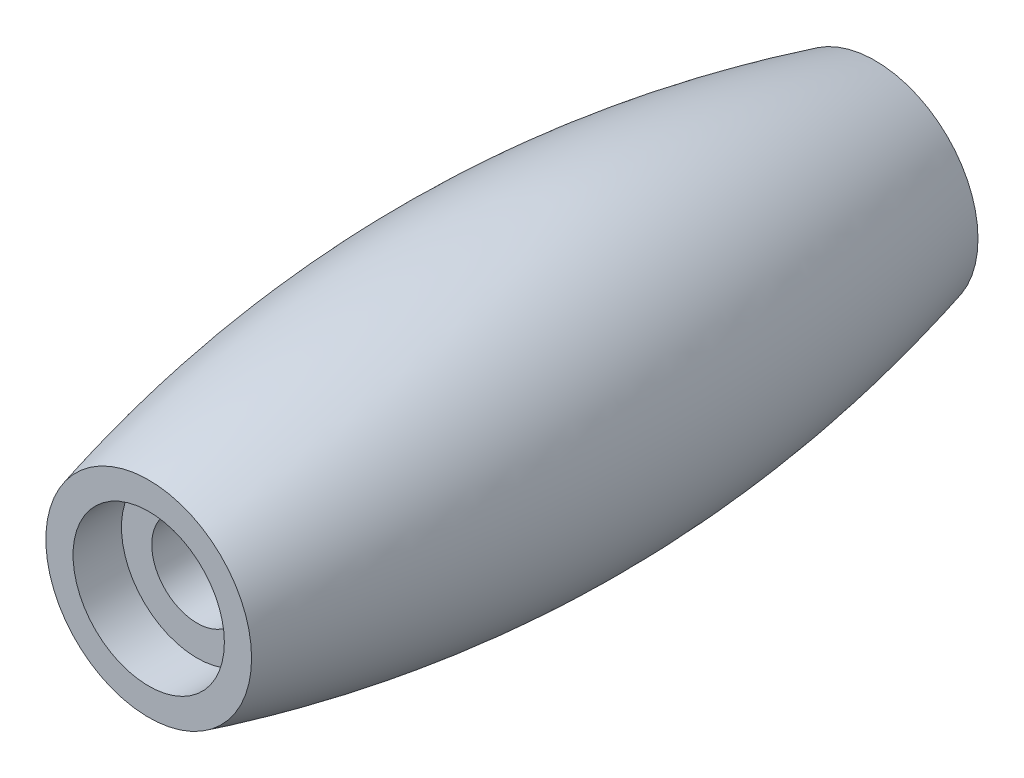
ISO-10303-21;
HEADER;
FILE_DESCRIPTION(('STEP AP214'),'2;1');
FILE_NAME('part.step','',(''),(''),'','','');
FILE_SCHEMA(('AUTOMOTIVE_DESIGN { 1 0 10303 214 1 1 1 1 }'));
ENDSEC;
DATA;
#1=APPLICATION_CONTEXT('core data for automotive mechanical design processes');
#2=APPLICATION_PROTOCOL_DEFINITION('international standard','automotive_design',2000,#1);
#3=PRODUCT_CONTEXT('',#1,'mechanical');
#4=PRODUCT('Part','Part','',(#3));
#5=PRODUCT_RELATED_PRODUCT_CATEGORY('part','',(#4));
#6=PRODUCT_DEFINITION_FORMATION('','',#4);
#7=PRODUCT_DEFINITION_CONTEXT('part definition',#1,'design');
#8=PRODUCT_DEFINITION('design','',#6,#7);
#9=PRODUCT_DEFINITION_SHAPE('','',#8);
#10=(LENGTH_UNIT() NAMED_UNIT(*) SI_UNIT(.MILLI.,.METRE.));
#11=(NAMED_UNIT(*) PLANE_ANGLE_UNIT() SI_UNIT($,.RADIAN.));
#12=(NAMED_UNIT(*) SI_UNIT($,.STERADIAN.) SOLID_ANGLE_UNIT());
#13=UNCERTAINTY_MEASURE_WITH_UNIT(LENGTH_MEASURE(1.E-05),#10,'distance_accuracy_value','');
#14=(GEOMETRIC_REPRESENTATION_CONTEXT(3) GLOBAL_UNCERTAINTY_ASSIGNED_CONTEXT((#13)) GLOBAL_UNIT_ASSIGNED_CONTEXT((#10,
#11,#12)) REPRESENTATION_CONTEXT('',''));
#15=CARTESIAN_POINT('',(0.,0.,0.));
#16=DIRECTION('',(0.,0.,1.));
#17=DIRECTION('',(1.,0.,0.));
#18=AXIS2_PLACEMENT_3D('',#15,#16,#17);
#19=CARTESIAN_POINT('',(-14.5058,11.2916405906895,14.268));
#20=DIRECTION('',(0.,0.,1.));
#21=DIRECTION('',(0.,1.,0.));
#22=AXIS2_PLACEMENT_3D('',#19,#20,#21);
#23=PLANE('',#22);
#24=CARTESIAN_POINT('',(0.,0.,14.268));
#25=DIRECTION('',(0.,0.,1.));
#26=DIRECTION('',(1.,0.,0.));
#27=AXIS2_PLACEMENT_3D('',#24,#25,#26);
#28=CIRCLE('',#27,4.04107808);
#29=CARTESIAN_POINT('',(4.04107808,0.,14.268));
#30=VERTEX_POINT('',#29);
#31=EDGE_CURVE('E11',#30,#30,#28,.F.);
#32=ORIENTED_EDGE('',*,*,#31,.F.);
#33=EDGE_LOOP('',(#32));
#34=FACE_BOUND('',#33,.T.);
#35=CARTESIAN_POINT('',(0.,0.,14.268));
#36=DIRECTION('',(0.,0.,1.));
#37=DIRECTION('',(1.,0.,0.));
#38=AXIS2_PLACEMENT_3D('',#35,#36,#37);
#39=CIRCLE('',#38,2.9725);
#40=CARTESIAN_POINT('',(2.9725,0.,14.268));
#41=VERTEX_POINT('',#40);
#42=EDGE_CURVE('E63',#41,#41,#39,.T.);
#43=ORIENTED_EDGE('',*,*,#42,.F.);
#44=EDGE_LOOP('',(#43));
#45=FACE_BOUND('',#44,.T.);
#46=ADVANCED_FACE('F33',(#34,#45),#23,.T.);
#47=CARTESIAN_POINT('',(0.,0.,14.268));
#48=DIRECTION('',(0.,0.,-1.));
#49=DIRECTION('',(1.,0.,0.));
#50=AXIS2_PLACEMENT_3D('',#47,#48,#49);
#51=CYLINDRICAL_SURFACE('',#50,1.7835);
#52=CARTESIAN_POINT('',(0.,0.,-12.3656));
#53=DIRECTION('',(0.,0.,1.));
#54=DIRECTION('',(1.,0.,0.));
#55=AXIS2_PLACEMENT_3D('',#52,#53,#54);
#56=CIRCLE('',#55,1.7835);
#57=CARTESIAN_POINT('',(1.7835,0.,-12.3656));
#58=VERTEX_POINT('',#57);
#59=EDGE_CURVE('E58',#58,#58,#56,.T.);
#60=CARTESIAN_POINT('',(0.,0.,12.3656));
#61=DIRECTION('',(0.,0.,-1.));
#62=DIRECTION('',(-1.,0.,0.));
#63=AXIS2_PLACEMENT_3D('',#60,#61,#62);
#64=CIRCLE('',#63,1.7835);
#65=CARTESIAN_POINT('',(1.7835,0.,12.3656));
#66=VERTEX_POINT('',#65);
#67=EDGE_CURVE('E38',#66,#66,#64,.F.);
#68=CARTESIAN_POINT('',(1.7835,0.,-12.3656));
#69=CARTESIAN_POINT('',(1.7835,0.,-12.1079833333333));
#70=CARTESIAN_POINT('',(1.7835,0.,-11.8503666666667));
#71=CARTESIAN_POINT('',(1.7835,0.,-11.3351333333333));
#72=CARTESIAN_POINT('',(1.7835,0.,-11.0775166666667));
#73=CARTESIAN_POINT('',(1.7835,0.,-10.5622833333333));
#74=CARTESIAN_POINT('',(1.7835,0.,-10.3046666666667));
#75=CARTESIAN_POINT('',(1.7835,0.,-9.78943333333333));
#76=CARTESIAN_POINT('',(1.7835,0.,-9.53181666666666));
#77=CARTESIAN_POINT('',(1.7835,0.,-9.01658333333333));
#78=CARTESIAN_POINT('',(1.7835,0.,-8.75896666666666));
#79=CARTESIAN_POINT('',(1.7835,0.,-8.24373333333333));
#80=CARTESIAN_POINT('',(1.7835,0.,-7.98611666666667));
#81=CARTESIAN_POINT('',(1.7835,0.,-7.47088333333333));
#82=CARTESIAN_POINT('',(1.7835,0.,-7.21326666666666));
#83=CARTESIAN_POINT('',(1.7835,0.,-6.69803333333333));
#84=CARTESIAN_POINT('',(1.7835,0.,-6.44041666666666));
#85=CARTESIAN_POINT('',(1.7835,0.,-5.92518333333333));
#86=CARTESIAN_POINT('',(1.7835,0.,-5.66756666666666));
#87=CARTESIAN_POINT('',(1.7835,0.,-5.15233333333333));
#88=CARTESIAN_POINT('',(1.7835,0.,-4.89471666666666));
#89=CARTESIAN_POINT('',(1.7835,0.,-4.37948333333333));
#90=CARTESIAN_POINT('',(1.7835,0.,-4.12186666666666));
#91=CARTESIAN_POINT('',(1.7835,0.,-3.60663333333333));
#92=CARTESIAN_POINT('',(1.7835,0.,-3.34901666666666));
#93=CARTESIAN_POINT('',(1.7835,0.,-2.83378333333333));
#94=CARTESIAN_POINT('',(1.7835,0.,-2.57616666666666));
#95=CARTESIAN_POINT('',(1.7835,0.,-2.06093333333333));
#96=CARTESIAN_POINT('',(1.7835,0.,-1.80331666666666));
#97=CARTESIAN_POINT('',(1.7835,0.,-1.28808333333333));
#98=CARTESIAN_POINT('',(1.7835,0.,-1.03046666666666));
#99=CARTESIAN_POINT('',(1.7835,0.,-0.515233333333332));
#100=CARTESIAN_POINT('',(1.7835,0.,-0.257616666666665));
#101=CARTESIAN_POINT('',(1.7835,0.,0.257616666666668));
#102=CARTESIAN_POINT('',(1.7835,0.,0.515233333333335));
#103=CARTESIAN_POINT('',(1.7835,0.,1.03046666666667));
#104=CARTESIAN_POINT('',(1.7835,0.,1.28808333333334));
#105=CARTESIAN_POINT('',(1.7835,0.,1.80331666666667));
#106=CARTESIAN_POINT('',(1.7835,0.,2.06093333333334));
#107=CARTESIAN_POINT('',(1.7835,0.,2.57616666666667));
#108=CARTESIAN_POINT('',(1.7835,0.,2.83378333333334));
#109=CARTESIAN_POINT('',(1.7835,0.,3.34901666666667));
#110=CARTESIAN_POINT('',(1.7835,0.,3.60663333333334));
#111=CARTESIAN_POINT('',(1.7835,0.,4.12186666666667));
#112=CARTESIAN_POINT('',(1.7835,0.,4.37948333333334));
#113=CARTESIAN_POINT('',(1.7835,0.,4.89471666666667));
#114=CARTESIAN_POINT('',(1.7835,0.,5.15233333333334));
#115=CARTESIAN_POINT('',(1.7835,0.,5.66756666666667));
#116=CARTESIAN_POINT('',(1.7835,0.,5.92518333333333));
#117=CARTESIAN_POINT('',(1.7835,0.,6.44041666666667));
#118=CARTESIAN_POINT('',(1.7835,0.,6.69803333333333));
#119=CARTESIAN_POINT('',(1.7835,0.,7.21326666666667));
#120=CARTESIAN_POINT('',(1.7835,0.,7.47088333333333));
#121=CARTESIAN_POINT('',(1.7835,0.,7.98611666666667));
#122=CARTESIAN_POINT('',(1.7835,0.,8.24373333333333));
#123=CARTESIAN_POINT('',(1.7835,0.,8.75896666666667));
#124=CARTESIAN_POINT('',(1.7835,0.,9.01658333333333));
#125=CARTESIAN_POINT('',(1.7835,0.,9.53181666666667));
#126=CARTESIAN_POINT('',(1.7835,0.,9.78943333333333));
#127=CARTESIAN_POINT('',(1.7835,0.,10.3046666666667));
#128=CARTESIAN_POINT('',(1.7835,0.,10.5622833333333));
#129=CARTESIAN_POINT('',(1.7835,0.,11.0775166666667));
#130=CARTESIAN_POINT('',(1.7835,0.,11.3351333333333));
#131=CARTESIAN_POINT('',(1.7835,0.,11.8503666666667));
#132=CARTESIAN_POINT('',(1.7835,0.,12.1079833333333));
#133=CARTESIAN_POINT('',(1.7835,0.,12.3656));
#134=B_SPLINE_CURVE_WITH_KNOTS('',3,(#68,#69,#70,#71,#72,#73,#74,#75,#76,#77,#78,#79,#80,#81,
#82,#83,#84,#85,#86,#87,#88,#89,#90,#91,#92,#93,#94,#95,#96,#97,#98,#99,#100,#101,#102,#103,
#104,#105,#106,#107,#108,#109,#110,#111,#112,#113,#114,#115,#116,#117,#118,#119,#120,#121,#122,
#123,#124,#125,#126,#127,#128,#129,#130,#131,#132,#133),.UNSPECIFIED.,.F.,.F.,(4,2,2,2,2,2,2,2,
2,2,2,2,2,2,2,2,2,2,2,2,2,2,2,2,2,2,2,2,2,2,2,2,4),(0.,0.772849999999998,1.5457,2.31855,3.0914,
3.86425,4.6371,5.40995,6.1828,6.95565,7.7285,8.50135,9.2742,10.04705,10.8199,11.59275,12.3656,
13.13845,13.9113,14.68415,15.457,16.22985,17.0027,17.77555,18.5484,19.32125,20.0941,20.86695,
21.6398,22.41265,23.1855,23.95835,24.7312),.UNSPECIFIED.);
#135=EDGE_CURVE('BSEAM73',#58,#66,#134,.T.);
#136=ORIENTED_EDGE('',*,*,#59,.F.);
#137=ORIENTED_EDGE('',*,*,#67,.T.);
#138=ORIENTED_EDGE('',*,*,#135,.T.);
#139=ORIENTED_EDGE('',*,*,#135,.F.);
#140=EDGE_LOOP('',(#136,#138,#137,#139));
#141=FACE_BOUND('',#140,.T.);
#142=ADVANCED_FACE('F73',(#141),#51,.F.);
#143=CARTESIAN_POINT('',(0.,-0.656328,23.78));
#144=CARTESIAN_POINT('',(0.,-11.233672,0.));
#145=CARTESIAN_POINT('',(0.,-0.656328000000006,-23.78));
#146=B_SPLINE_CURVE_WITH_KNOTS('',2,(#143,#144,#145),.UNSPECIFIED.,.F.,.F.,(3,3),(0.,1.),.UNSPECIFIED.);
#147=CARTESIAN_POINT('',(0.,0.,-23.78));
#148=DIRECTION('',(0.,0.,-1.));
#149=AXIS1_PLACEMENT('',#147,#148);
#150=SURFACE_OF_REVOLUTION('',#146,#149);
#151=CARTESIAN_POINT('',(0.,0.,-14.268));
#152=DIRECTION('',(0.,0.,1.));
#153=DIRECTION('',(1.,0.,0.));
#154=AXIS2_PLACEMENT_3D('',#151,#152,#153);
#155=CIRCLE('',#154,4.04107808);
#156=CARTESIAN_POINT('',(4.04107808,0.,-14.268));
#157=VERTEX_POINT('',#156);
#158=EDGE_CURVE('E42',#157,#157,#155,.T.);
#159=ORIENTED_EDGE('',*,*,#158,.T.);
#160=EDGE_LOOP('',(#159));
#161=FACE_BOUND('',#160,.T.);
#162=ORIENTED_EDGE('',*,*,#31,.T.);
#163=EDGE_LOOP('',(#162));
#164=FACE_BOUND('',#163,.T.);
#165=ADVANCED_FACE('F35',(#161,#164),#150,.T.);
#166=CARTESIAN_POINT('',(-14.5058,11.2916405906895,-14.268));
#167=DIRECTION('',(0.,0.,-1.));
#168=DIRECTION('',(0.,-1.,0.));
#169=AXIS2_PLACEMENT_3D('',#166,#167,#168);
#170=PLANE('',#169);
#171=CARTESIAN_POINT('',(0.,0.,-14.268));
#172=DIRECTION('',(0.,0.,1.));
#173=DIRECTION('',(1.,0.,0.));
#174=AXIS2_PLACEMENT_3D('',#171,#172,#173);
#175=CIRCLE('',#174,2.9725);
#176=CARTESIAN_POINT('',(2.9725,0.,-14.268));
#177=VERTEX_POINT('',#176);
#178=EDGE_CURVE('E52',#177,#177,#175,.T.);
#179=ORIENTED_EDGE('',*,*,#178,.T.);
#180=EDGE_LOOP('',(#179));
#181=FACE_BOUND('',#180,.T.);
#182=ORIENTED_EDGE('',*,*,#158,.F.);
#183=EDGE_LOOP('',(#182));
#184=FACE_BOUND('',#183,.T.);
#185=ADVANCED_FACE('F98',(#181,#184),#170,.T.);
#186=CARTESIAN_POINT('',(0.,0.,-12.3656));
#187=DIRECTION('',(0.,0.,-1.));
#188=DIRECTION('',(1.,0.,0.));
#189=AXIS2_PLACEMENT_3D('',#186,#187,#188);
#190=CYLINDRICAL_SURFACE('',#189,2.9725);
#191=CARTESIAN_POINT('',(0.,0.,-12.3656));
#192=DIRECTION('',(0.,0.,1.));
#193=DIRECTION('',(1.,0.,0.));
#194=AXIS2_PLACEMENT_3D('',#191,#192,#193);
#195=CIRCLE('',#194,2.9725);
#196=CARTESIAN_POINT('',(2.9725,0.,-12.3656));
#197=VERTEX_POINT('',#196);
#198=EDGE_CURVE('E46',#197,#197,#195,.T.);
#199=ORIENTED_EDGE('',*,*,#198,.T.);
#200=EDGE_LOOP('',(#199));
#201=FACE_BOUND('',#200,.T.);
#202=ORIENTED_EDGE('',*,*,#178,.F.);
#203=EDGE_LOOP('',(#202));
#204=FACE_BOUND('',#203,.T.);
#205=ADVANCED_FACE('F86',(#201,#204),#190,.F.);
#206=CARTESIAN_POINT('',(0.,0.,-12.3656));
#207=DIRECTION('',(0.,0.,-1.));
#208=DIRECTION('',(1.,0.,0.));
#209=AXIS2_PLACEMENT_3D('',#206,#207,#208);
#210=PLANE('',#209);
#211=ORIENTED_EDGE('',*,*,#59,.T.);
#212=EDGE_LOOP('',(#211));
#213=FACE_BOUND('',#212,.T.);
#214=ORIENTED_EDGE('',*,*,#198,.F.);
#215=EDGE_LOOP('',(#214));
#216=FACE_BOUND('',#215,.T.);
#217=ADVANCED_FACE('F78',(#213,#216),#210,.T.);
#218=CARTESIAN_POINT('',(0.,0.,12.3656));
#219=DIRECTION('',(0.,0.,1.));
#220=DIRECTION('',(1.,0.,0.));
#221=AXIS2_PLACEMENT_3D('',#218,#219,#220);
#222=PLANE('',#221);
#223=CARTESIAN_POINT('',(0.,0.,12.3656));
#224=DIRECTION('',(0.,0.,1.));
#225=DIRECTION('',(1.,0.,0.));
#226=AXIS2_PLACEMENT_3D('',#223,#224,#225);
#227=CIRCLE('',#226,2.9725);
#228=CARTESIAN_POINT('',(2.9725,0.,12.3656));
#229=VERTEX_POINT('',#228);
#230=EDGE_CURVE('E66',#229,#229,#227,.T.);
#231=ORIENTED_EDGE('',*,*,#230,.T.);
#232=EDGE_LOOP('',(#231));
#233=FACE_BOUND('',#232,.T.);
#234=ORIENTED_EDGE('',*,*,#67,.F.);
#235=EDGE_LOOP('',(#234));
#236=FACE_BOUND('',#235,.T.);
#237=ADVANCED_FACE('F75',(#233,#236),#222,.T.);
#238=CARTESIAN_POINT('',(0.,0.,12.3656));
#239=DIRECTION('',(0.,0.,1.));
#240=DIRECTION('',(-1.,0.,0.));
#241=AXIS2_PLACEMENT_3D('',#238,#239,#240);
#242=CYLINDRICAL_SURFACE('',#241,2.9725);
#243=ORIENTED_EDGE('',*,*,#230,.F.);
#244=EDGE_LOOP('',(#243));
#245=FACE_BOUND('',#244,.T.);
#246=ORIENTED_EDGE('',*,*,#42,.T.);
#247=EDGE_LOOP('',(#246));
#248=FACE_BOUND('',#247,.T.);
#249=ADVANCED_FACE('F77',(#245,#248),#242,.F.);
#250=CLOSED_SHELL('',(#46,#142,#165,#185,#205,#217,#237,#249));
#251=MANIFOLD_SOLID_BREP('B2',#250);
#252=ADVANCED_BREP_SHAPE_REPRESENTATION('',(#18,#251),#14);
#253=SHAPE_DEFINITION_REPRESENTATION(#9,#252);
ENDSEC;
END-ISO-10303-21;
